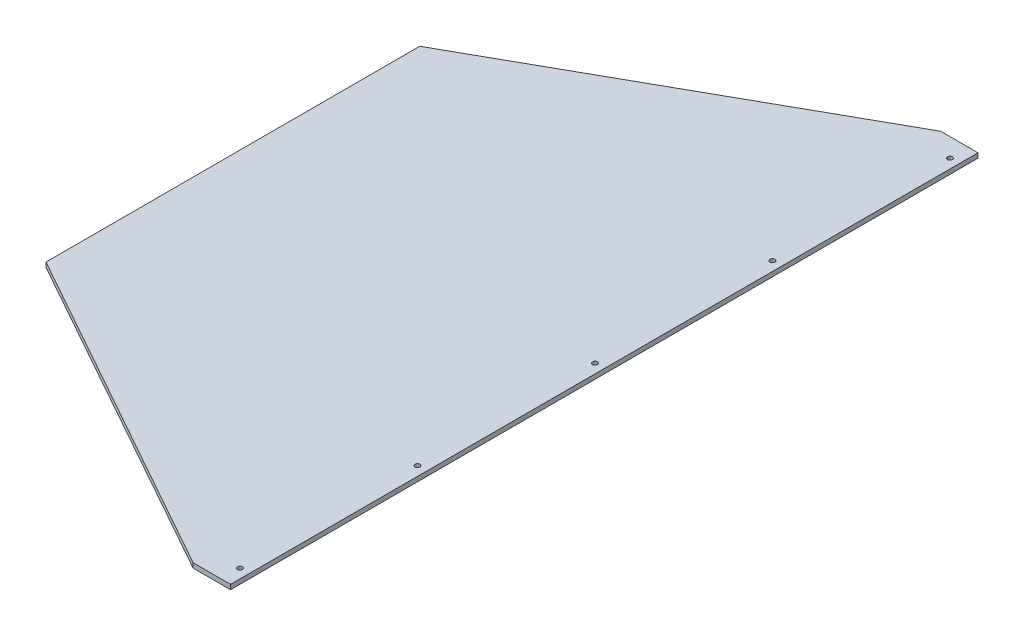
ISO-10303-21;
HEADER;
FILE_DESCRIPTION(('STEP AP214'),'2;1');
FILE_NAME('part.step','',(''),(''),'','','');
FILE_SCHEMA(('AUTOMOTIVE_DESIGN { 1 0 10303 214 1 1 1 1 }'));
ENDSEC;
DATA;
#1=APPLICATION_CONTEXT('core data for automotive mechanical design processes');
#2=APPLICATION_PROTOCOL_DEFINITION('international standard','automotive_design',2000,#1);
#3=PRODUCT_CONTEXT('',#1,'mechanical');
#4=PRODUCT('Part','Part','',(#3));
#5=PRODUCT_RELATED_PRODUCT_CATEGORY('part','',(#4));
#6=PRODUCT_DEFINITION_FORMATION('','',#4);
#7=PRODUCT_DEFINITION_CONTEXT('part definition',#1,'design');
#8=PRODUCT_DEFINITION('design','',#6,#7);
#9=PRODUCT_DEFINITION_SHAPE('','',#8);
#10=(LENGTH_UNIT() NAMED_UNIT(*) SI_UNIT(.MILLI.,.METRE.));
#11=(NAMED_UNIT(*) PLANE_ANGLE_UNIT() SI_UNIT($,.RADIAN.));
#12=(NAMED_UNIT(*) SI_UNIT($,.STERADIAN.) SOLID_ANGLE_UNIT());
#13=UNCERTAINTY_MEASURE_WITH_UNIT(LENGTH_MEASURE(1.E-05),#10,'distance_accuracy_value','');
#14=(GEOMETRIC_REPRESENTATION_CONTEXT(3) GLOBAL_UNCERTAINTY_ASSIGNED_CONTEXT((#13)) GLOBAL_UNIT_ASSIGNED_CONTEXT((#10,
#11,#12)) REPRESENTATION_CONTEXT('',''));
#15=CARTESIAN_POINT('',(0.,0.,0.));
#16=DIRECTION('',(0.,0.,1.));
#17=DIRECTION('',(1.,0.,0.));
#18=AXIS2_PLACEMENT_3D('',#15,#16,#17);
#19=CARTESIAN_POINT('',(0.,6.35,0.));
#20=DIRECTION('',(0.,1.,0.));
#21=DIRECTION('',(0.,0.,1.));
#22=AXIS2_PLACEMENT_3D('',#19,#20,#21);
#23=PLANE('',#22);
#24=CARTESIAN_POINT('',(-727.075,6.35,736.6));
#25=DIRECTION('',(0.,1.,0.));
#26=DIRECTION('',(0.,0.,1.));
#27=AXIS2_PLACEMENT_3D('',#24,#25,#26);
#28=CIRCLE('',#27,3.3655);
#29=CARTESIAN_POINT('',(-727.075,6.35,739.9655));
#30=VERTEX_POINT('',#29);
#31=EDGE_CURVE('E109',#30,#30,#28,.F.);
#32=ORIENTED_EDGE('',*,*,#31,.T.);
#33=EDGE_LOOP('',(#32));
#34=FACE_BOUND('',#33,.T.);
#35=CARTESIAN_POINT('',(-727.075,6.35,495.3));
#36=DIRECTION('',(0.,1.,0.));
#37=DIRECTION('',(0.,0.,1.));
#38=AXIS2_PLACEMENT_3D('',#35,#36,#37);
#39=CIRCLE('',#38,3.3655);
#40=CARTESIAN_POINT('',(-727.075,6.35,498.6655));
#41=VERTEX_POINT('',#40);
#42=EDGE_CURVE('E112',#41,#41,#39,.F.);
#43=ORIENTED_EDGE('',*,*,#42,.T.);
#44=EDGE_LOOP('',(#43));
#45=FACE_BOUND('',#44,.T.);
#46=CARTESIAN_POINT('',(-727.075,6.35,254.));
#47=DIRECTION('',(0.,1.,0.));
#48=DIRECTION('',(0.,0.,1.));
#49=AXIS2_PLACEMENT_3D('',#46,#47,#48);
#50=CIRCLE('',#49,3.3655);
#51=CARTESIAN_POINT('',(-727.075,6.35,257.3655));
#52=VERTEX_POINT('',#51);
#53=EDGE_CURVE('E115',#52,#52,#50,.F.);
#54=ORIENTED_EDGE('',*,*,#53,.T.);
#55=EDGE_LOOP('',(#54));
#56=FACE_BOUND('',#55,.T.);
#57=CARTESIAN_POINT('',(-727.075,6.35,12.7));
#58=DIRECTION('',(0.,1.,0.));
#59=DIRECTION('',(0.,0.,1.));
#60=AXIS2_PLACEMENT_3D('',#57,#58,#59);
#61=CIRCLE('',#60,3.3655);
#62=CARTESIAN_POINT('',(-727.075,6.35,16.0655));
#63=VERTEX_POINT('',#62);
#64=EDGE_CURVE('E117',#63,#63,#61,.F.);
#65=ORIENTED_EDGE('',*,*,#64,.T.);
#66=EDGE_LOOP('',(#65));
#67=FACE_BOUND('',#66,.T.);
#68=CARTESIAN_POINT('',(-727.075,6.35,-228.6));
#69=DIRECTION('',(0.,1.,0.));
#70=DIRECTION('',(0.,0.,1.));
#71=AXIS2_PLACEMENT_3D('',#68,#69,#70);
#72=CIRCLE('',#71,3.3655);
#73=CARTESIAN_POINT('',(-727.075,6.35,-225.2345));
#74=VERTEX_POINT('',#73);
#75=EDGE_CURVE('E20',#74,#74,#72,.F.);
#76=ORIENTED_EDGE('',*,*,#75,.T.);
#77=EDGE_LOOP('',(#76));
#78=FACE_BOUND('',#77,.T.);
#79=DIRECTION('',(0.,0.,1.));
#80=VECTOR('',#79,1.);
#81=CARTESIAN_POINT('',(-1219.2,6.35,0.));
#82=LINE('',#81,#80);
#83=CARTESIAN_POINT('',(-1219.2,6.35,508.));
#84=VERTEX_POINT('',#83);
#85=CARTESIAN_POINT('',(-1219.2,6.35,-8.32667268468867E-13));
#86=VERTEX_POINT('',#85);
#87=EDGE_CURVE('E85',#84,#86,#82,.F.);
#88=ORIENTED_EDGE('',*,*,#87,.F.);
#89=DIRECTION('',(0.872714074517284,0.,0.488231650079591));
#90=VECTOR('',#89,1.);
#91=CARTESIAN_POINT('',(-1219.2,6.35,508.));
#92=LINE('',#91,#90);
#93=CARTESIAN_POINT('',(-765.174999999999,6.35,761.999999999999));
#94=VERTEX_POINT('',#93);
#95=EDGE_CURVE('E81',#94,#84,#92,.F.);
#96=ORIENTED_EDGE('',*,*,#95,.F.);
#97=DIRECTION('',(1.,0.,0.));
#98=VECTOR('',#97,1.);
#99=CARTESIAN_POINT('',(-765.175,6.35,762.));
#100=LINE('',#99,#98);
#101=CARTESIAN_POINT('',(-714.375,6.35,762.));
#102=VERTEX_POINT('',#101);
#103=EDGE_CURVE('E72',#102,#94,#100,.F.);
#104=ORIENTED_EDGE('',*,*,#103,.F.);
#105=DIRECTION('',(0.,0.,-1.));
#106=VECTOR('',#105,1.);
#107=CARTESIAN_POINT('',(-714.375,6.35,762.));
#108=LINE('',#107,#106);
#109=CARTESIAN_POINT('',(-714.375,6.35,-254.));
#110=VERTEX_POINT('',#109);
#111=EDGE_CURVE('E67',#110,#102,#108,.F.);
#112=ORIENTED_EDGE('',*,*,#111,.F.);
#113=DIRECTION('',(-1.,0.,0.));
#114=VECTOR('',#113,1.);
#115=CARTESIAN_POINT('',(-714.375,6.35,-254.));
#116=LINE('',#115,#114);
#117=CARTESIAN_POINT('',(-765.175,6.35,-254.));
#118=VERTEX_POINT('',#117);
#119=EDGE_CURVE('E137',#118,#110,#116,.F.);
#120=ORIENTED_EDGE('',*,*,#119,.F.);
#121=DIRECTION('',(-0.872714074517284,0.,0.488231650079591));
#122=VECTOR('',#121,1.);
#123=CARTESIAN_POINT('',(-765.175,6.35,-254.));
#124=LINE('',#123,#122);
#125=EDGE_CURVE('E133',#86,#118,#124,.F.);
#126=ORIENTED_EDGE('',*,*,#125,.F.);
#127=EDGE_LOOP('',(#88,#96,#104,#112,#120,#126));
#128=FACE_BOUND('',#127,.T.);
#129=ADVANCED_FACE('F17',(#34,#45,#56,#67,#78,#128),#23,.T.);
#130=CARTESIAN_POINT('',(-1219.2,0.,508.));
#131=DIRECTION('',(-0.488231650079591,0.,0.872714074517284));
#132=DIRECTION('',(0.872714074517284,0.,0.488231650079591));
#133=AXIS2_PLACEMENT_3D('',#130,#131,#132);
#134=PLANE('',#133);
#135=DIRECTION('',(0.,1.,0.));
#136=VECTOR('',#135,1.);
#137=CARTESIAN_POINT('',(-1219.2,0.,508.));
#138=LINE('',#137,#136);
#139=CARTESIAN_POINT('',(-1219.2,0.,508.));
#140=VERTEX_POINT('',#139);
#141=EDGE_CURVE('E125',#140,#84,#138,.T.);
#142=ORIENTED_EDGE('',*,*,#141,.F.);
#143=DIRECTION('',(0.872714074517281,0.,0.488231650079598));
#144=VECTOR('',#143,1.);
#145=CARTESIAN_POINT('',(-1219.2,0.,508.));
#146=LINE('',#145,#144);
#147=CARTESIAN_POINT('',(-765.174999999999,0.,761.999999999998));
#148=VERTEX_POINT('',#147);
#149=EDGE_CURVE('E92',#140,#148,#146,.T.);
#150=ORIENTED_EDGE('',*,*,#149,.T.);
#151=DIRECTION('',(0.,1.,0.));
#152=VECTOR('',#151,1.);
#153=CARTESIAN_POINT('',(-765.175,0.,762.));
#154=LINE('',#153,#152);
#155=EDGE_CURVE('E77',#94,#148,#154,.F.);
#156=ORIENTED_EDGE('',*,*,#155,.F.);
#157=ORIENTED_EDGE('',*,*,#95,.T.);
#158=EDGE_LOOP('',(#142,#150,#156,#157));
#159=FACE_BOUND('',#158,.T.);
#160=ADVANCED_FACE('F91',(#159),#134,.T.);
#161=CARTESIAN_POINT('',(-765.175,0.,762.));
#162=DIRECTION('',(0.,0.,1.));
#163=DIRECTION('',(1.,0.,0.));
#164=AXIS2_PLACEMENT_3D('',#161,#162,#163);
#165=PLANE('',#164);
#166=ORIENTED_EDGE('',*,*,#155,.T.);
#167=DIRECTION('',(1.,0.,0.));
#168=VECTOR('',#167,1.);
#169=CARTESIAN_POINT('',(0.,0.,762.));
#170=LINE('',#169,#168);
#171=CARTESIAN_POINT('',(-714.375,0.,762.));
#172=VERTEX_POINT('',#171);
#173=EDGE_CURVE('E146',#148,#172,#170,.T.);
#174=ORIENTED_EDGE('',*,*,#173,.T.);
#175=DIRECTION('',(0.,1.,0.));
#176=VECTOR('',#175,1.);
#177=CARTESIAN_POINT('',(-714.375,0.,762.));
#178=LINE('',#177,#176);
#179=EDGE_CURVE('E79',#102,#172,#178,.F.);
#180=ORIENTED_EDGE('',*,*,#179,.F.);
#181=ORIENTED_EDGE('',*,*,#103,.T.);
#182=EDGE_LOOP('',(#166,#174,#180,#181));
#183=FACE_BOUND('',#182,.T.);
#184=ADVANCED_FACE('F74',(#183),#165,.T.);
#185=CARTESIAN_POINT('',(-714.375,0.,762.));
#186=DIRECTION('',(1.,0.,0.));
#187=DIRECTION('',(0.,0.,-1.));
#188=AXIS2_PLACEMENT_3D('',#185,#186,#187);
#189=PLANE('',#188);
#190=ORIENTED_EDGE('',*,*,#179,.T.);
#191=DIRECTION('',(0.,0.,1.));
#192=VECTOR('',#191,1.);
#193=CARTESIAN_POINT('',(-714.375,0.,0.));
#194=LINE('',#193,#192);
#195=CARTESIAN_POINT('',(-714.375,0.,-254.));
#196=VERTEX_POINT('',#195);
#197=EDGE_CURVE('E141',#172,#196,#194,.F.);
#198=ORIENTED_EDGE('',*,*,#197,.T.);
#199=DIRECTION('',(0.,1.,0.));
#200=VECTOR('',#199,1.);
#201=CARTESIAN_POINT('',(-714.375,0.,-254.));
#202=LINE('',#201,#200);
#203=EDGE_CURVE('E135',#110,#196,#202,.F.);
#204=ORIENTED_EDGE('',*,*,#203,.F.);
#205=ORIENTED_EDGE('',*,*,#111,.T.);
#206=EDGE_LOOP('',(#190,#198,#204,#205));
#207=FACE_BOUND('',#206,.T.);
#208=ADVANCED_FACE('F140',(#207),#189,.T.);
#209=CARTESIAN_POINT('',(-714.375,0.,-254.));
#210=DIRECTION('',(0.,0.,-1.));
#211=DIRECTION('',(-1.,0.,0.));
#212=AXIS2_PLACEMENT_3D('',#209,#210,#211);
#213=PLANE('',#212);
#214=ORIENTED_EDGE('',*,*,#203,.T.);
#215=DIRECTION('',(1.,0.,0.));
#216=VECTOR('',#215,1.);
#217=CARTESIAN_POINT('',(0.,0.,-254.));
#218=LINE('',#217,#216);
#219=CARTESIAN_POINT('',(-765.175,0.,-254.));
#220=VERTEX_POINT('',#219);
#221=EDGE_CURVE('E148',#196,#220,#218,.F.);
#222=ORIENTED_EDGE('',*,*,#221,.T.);
#223=DIRECTION('',(0.,1.,0.));
#224=VECTOR('',#223,1.);
#225=CARTESIAN_POINT('',(-765.175,0.,-254.));
#226=LINE('',#225,#224);
#227=EDGE_CURVE('E131',#118,#220,#226,.F.);
#228=ORIENTED_EDGE('',*,*,#227,.F.);
#229=ORIENTED_EDGE('',*,*,#119,.T.);
#230=EDGE_LOOP('',(#214,#222,#228,#229));
#231=FACE_BOUND('',#230,.T.);
#232=ADVANCED_FACE('F161',(#231),#213,.T.);
#233=CARTESIAN_POINT('',(-765.175,0.,-254.));
#234=DIRECTION('',(-0.488231650079591,0.,-0.872714074517284));
#235=DIRECTION('',(-0.872714074517284,0.,0.488231650079591));
#236=AXIS2_PLACEMENT_3D('',#233,#234,#235);
#237=PLANE('',#236);
#238=ORIENTED_EDGE('',*,*,#227,.T.);
#239=DIRECTION('',(-0.872714074517281,0.,0.488231650079598));
#240=VECTOR('',#239,1.);
#241=CARTESIAN_POINT('',(-765.175,0.,-254.));
#242=LINE('',#241,#240);
#243=CARTESIAN_POINT('',(-1219.2,0.,-1.66533453693773E-12));
#244=VERTEX_POINT('',#243);
#245=EDGE_CURVE('E152',#220,#244,#242,.T.);
#246=ORIENTED_EDGE('',*,*,#245,.T.);
#247=DIRECTION('',(0.,1.,0.));
#248=VECTOR('',#247,1.);
#249=CARTESIAN_POINT('',(-1219.2,0.,0.));
#250=LINE('',#249,#248);
#251=EDGE_CURVE('E35',#86,#244,#250,.F.);
#252=ORIENTED_EDGE('',*,*,#251,.F.);
#253=ORIENTED_EDGE('',*,*,#125,.T.);
#254=EDGE_LOOP('',(#238,#246,#252,#253));
#255=FACE_BOUND('',#254,.T.);
#256=ADVANCED_FACE('F157',(#255),#237,.T.);
#257=CARTESIAN_POINT('',(-1219.2,0.,0.));
#258=DIRECTION('',(-1.,0.,0.));
#259=DIRECTION('',(0.,0.,1.));
#260=AXIS2_PLACEMENT_3D('',#257,#258,#259);
#261=PLANE('',#260);
#262=ORIENTED_EDGE('',*,*,#251,.T.);
#263=DIRECTION('',(0.,0.,1.));
#264=VECTOR('',#263,1.);
#265=CARTESIAN_POINT('',(-1219.2,0.,0.));
#266=LINE('',#265,#264);
#267=EDGE_CURVE('E108',#244,#140,#266,.T.);
#268=ORIENTED_EDGE('',*,*,#267,.T.);
#269=ORIENTED_EDGE('',*,*,#141,.T.);
#270=ORIENTED_EDGE('',*,*,#87,.T.);
#271=EDGE_LOOP('',(#262,#268,#269,#270));
#272=FACE_BOUND('',#271,.T.);
#273=ADVANCED_FACE('F155',(#272),#261,.T.);
#274=CARTESIAN_POINT('',(-727.075,6.35,-228.6));
#275=DIRECTION('',(0.,1.,0.));
#276=DIRECTION('',(0.,0.,1.));
#277=AXIS2_PLACEMENT_3D('',#274,#275,#276);
#278=CYLINDRICAL_SURFACE('',#277,3.3655);
#279=ORIENTED_EDGE('',*,*,#75,.F.);
#280=EDGE_LOOP('',(#279));
#281=FACE_BOUND('',#280,.T.);
#282=CARTESIAN_POINT('',(-727.075,0.,-228.6));
#283=DIRECTION('',(0.,1.,0.));
#284=DIRECTION('',(0.,0.,1.));
#285=AXIS2_PLACEMENT_3D('',#282,#283,#284);
#286=CIRCLE('',#285,3.3655);
#287=CARTESIAN_POINT('',(-727.075,0.,-225.2345));
#288=VERTEX_POINT('',#287);
#289=EDGE_CURVE('E105',#288,#288,#286,.F.);
#290=ORIENTED_EDGE('',*,*,#289,.T.);
#291=EDGE_LOOP('',(#290));
#292=FACE_BOUND('',#291,.T.);
#293=ADVANCED_FACE('F194',(#281,#292),#278,.F.);
#294=CARTESIAN_POINT('',(-727.075,6.35,12.7));
#295=DIRECTION('',(0.,1.,0.));
#296=DIRECTION('',(0.,0.,1.));
#297=AXIS2_PLACEMENT_3D('',#294,#295,#296);
#298=CYLINDRICAL_SURFACE('',#297,3.3655);
#299=ORIENTED_EDGE('',*,*,#64,.F.);
#300=EDGE_LOOP('',(#299));
#301=FACE_BOUND('',#300,.T.);
#302=CARTESIAN_POINT('',(-727.075,0.,12.7));
#303=DIRECTION('',(0.,1.,0.));
#304=DIRECTION('',(0.,0.,1.));
#305=AXIS2_PLACEMENT_3D('',#302,#303,#304);
#306=CIRCLE('',#305,3.3655);
#307=CARTESIAN_POINT('',(-727.075,0.,16.0655));
#308=VERTEX_POINT('',#307);
#309=EDGE_CURVE('E102',#308,#308,#306,.F.);
#310=ORIENTED_EDGE('',*,*,#309,.T.);
#311=EDGE_LOOP('',(#310));
#312=FACE_BOUND('',#311,.T.);
#313=ADVANCED_FACE('F190',(#301,#312),#298,.F.);
#314=CARTESIAN_POINT('',(-727.075,6.35,254.));
#315=DIRECTION('',(0.,1.,0.));
#316=DIRECTION('',(0.,0.,1.));
#317=AXIS2_PLACEMENT_3D('',#314,#315,#316);
#318=CYLINDRICAL_SURFACE('',#317,3.3655);
#319=ORIENTED_EDGE('',*,*,#53,.F.);
#320=EDGE_LOOP('',(#319));
#321=FACE_BOUND('',#320,.T.);
#322=CARTESIAN_POINT('',(-727.075,0.,254.));
#323=DIRECTION('',(0.,1.,0.));
#324=DIRECTION('',(0.,0.,1.));
#325=AXIS2_PLACEMENT_3D('',#322,#323,#324);
#326=CIRCLE('',#325,3.3655);
#327=CARTESIAN_POINT('',(-727.075,0.,257.3655));
#328=VERTEX_POINT('',#327);
#329=EDGE_CURVE('E99',#328,#328,#326,.F.);
#330=ORIENTED_EDGE('',*,*,#329,.T.);
#331=EDGE_LOOP('',(#330));
#332=FACE_BOUND('',#331,.T.);
#333=ADVANCED_FACE('F186',(#321,#332),#318,.F.);
#334=CARTESIAN_POINT('',(-727.075,6.35,495.3));
#335=DIRECTION('',(0.,1.,0.));
#336=DIRECTION('',(0.,0.,1.));
#337=AXIS2_PLACEMENT_3D('',#334,#335,#336);
#338=CYLINDRICAL_SURFACE('',#337,3.3655);
#339=ORIENTED_EDGE('',*,*,#42,.F.);
#340=EDGE_LOOP('',(#339));
#341=FACE_BOUND('',#340,.T.);
#342=CARTESIAN_POINT('',(-727.075,0.,495.3));
#343=DIRECTION('',(0.,1.,0.));
#344=DIRECTION('',(0.,0.,1.));
#345=AXIS2_PLACEMENT_3D('',#342,#343,#344);
#346=CIRCLE('',#345,3.3655);
#347=CARTESIAN_POINT('',(-727.075,0.,498.6655));
#348=VERTEX_POINT('',#347);
#349=EDGE_CURVE('E26',#348,#348,#346,.F.);
#350=ORIENTED_EDGE('',*,*,#349,.T.);
#351=EDGE_LOOP('',(#350));
#352=FACE_BOUND('',#351,.T.);
#353=ADVANCED_FACE('F178',(#341,#352),#338,.F.);
#354=CARTESIAN_POINT('',(-727.075,6.35,736.6));
#355=DIRECTION('',(0.,1.,0.));
#356=DIRECTION('',(0.,0.,1.));
#357=AXIS2_PLACEMENT_3D('',#354,#355,#356);
#358=CYLINDRICAL_SURFACE('',#357,3.3655);
#359=ORIENTED_EDGE('',*,*,#31,.F.);
#360=EDGE_LOOP('',(#359));
#361=FACE_BOUND('',#360,.T.);
#362=CARTESIAN_POINT('',(-727.075,0.,736.6));
#363=DIRECTION('',(0.,1.,0.));
#364=DIRECTION('',(0.,0.,1.));
#365=AXIS2_PLACEMENT_3D('',#362,#363,#364);
#366=CIRCLE('',#365,3.3655);
#367=CARTESIAN_POINT('',(-727.075,0.,739.9655));
#368=VERTEX_POINT('',#367);
#369=EDGE_CURVE('E11',#368,#368,#366,.F.);
#370=ORIENTED_EDGE('',*,*,#369,.T.);
#371=EDGE_LOOP('',(#370));
#372=FACE_BOUND('',#371,.T.);
#373=ADVANCED_FACE('F172',(#361,#372),#358,.F.);
#374=CARTESIAN_POINT('',(0.,0.,0.));
#375=DIRECTION('',(0.,1.,0.));
#376=DIRECTION('',(0.,0.,1.));
#377=AXIS2_PLACEMENT_3D('',#374,#375,#376);
#378=PLANE('',#377);
#379=ORIENTED_EDGE('',*,*,#369,.F.);
#380=EDGE_LOOP('',(#379));
#381=FACE_BOUND('',#380,.T.);
#382=ORIENTED_EDGE('',*,*,#349,.F.);
#383=EDGE_LOOP('',(#382));
#384=FACE_BOUND('',#383,.T.);
#385=ORIENTED_EDGE('',*,*,#329,.F.);
#386=EDGE_LOOP('',(#385));
#387=FACE_BOUND('',#386,.T.);
#388=ORIENTED_EDGE('',*,*,#309,.F.);
#389=EDGE_LOOP('',(#388));
#390=FACE_BOUND('',#389,.T.);
#391=ORIENTED_EDGE('',*,*,#289,.F.);
#392=EDGE_LOOP('',(#391));
#393=FACE_BOUND('',#392,.T.);
#394=ORIENTED_EDGE('',*,*,#245,.F.);
#395=ORIENTED_EDGE('',*,*,#221,.F.);
#396=ORIENTED_EDGE('',*,*,#197,.F.);
#397=ORIENTED_EDGE('',*,*,#173,.F.);
#398=ORIENTED_EDGE('',*,*,#149,.F.);
#399=ORIENTED_EDGE('',*,*,#267,.F.);
#400=EDGE_LOOP('',(#394,#395,#396,#397,#398,#399));
#401=FACE_BOUND('',#400,.T.);
#402=ADVANCED_FACE('F145',(#381,#384,#387,#390,#393,#401),#378,.F.);
#403=CLOSED_SHELL('',(#129,#160,#184,#208,#232,#256,#273,#293,#313,#333,#353,#373,#402));
#404=MANIFOLD_SOLID_BREP('B1',#403);
#405=ADVANCED_BREP_SHAPE_REPRESENTATION('',(#18,#404),#14);
#406=SHAPE_DEFINITION_REPRESENTATION(#9,#405);
ENDSEC;
END-ISO-10303-21;
